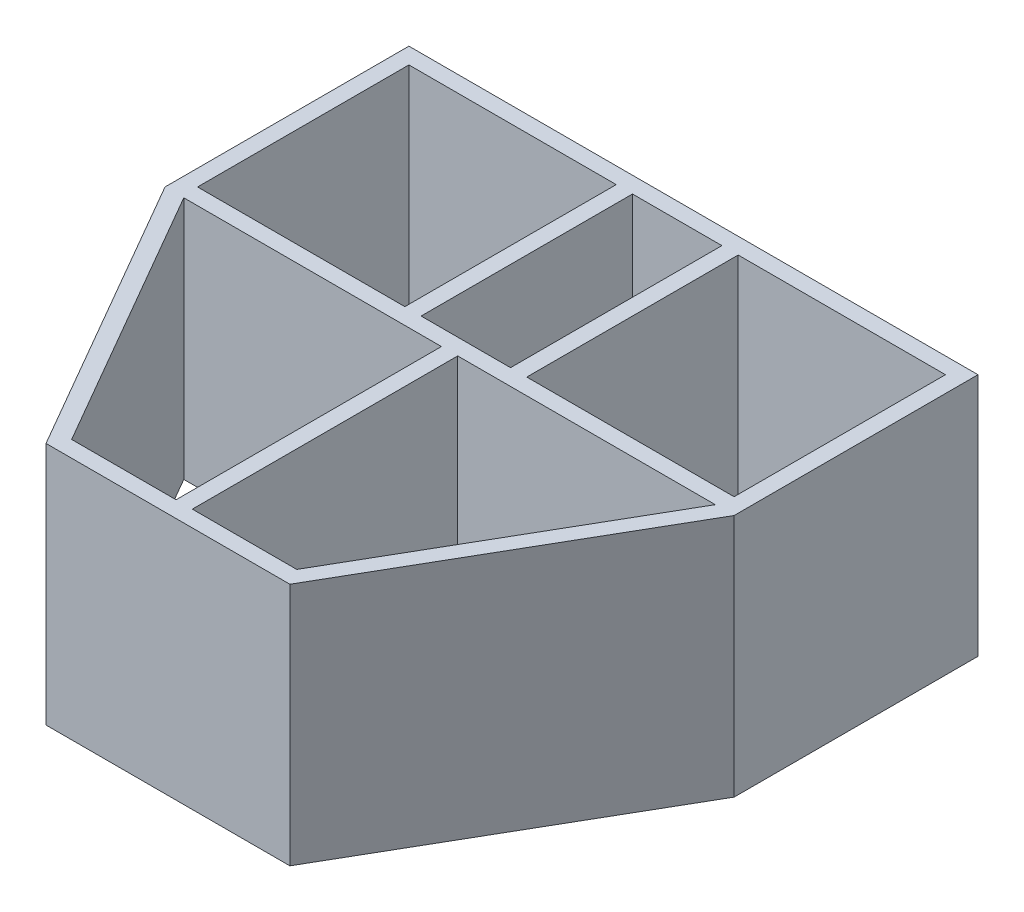
ISO-10303-21;
HEADER;
FILE_DESCRIPTION(('STEP AP214'),'2;1');
FILE_NAME('part.step','',(''),(''),'','','');
FILE_SCHEMA(('AUTOMOTIVE_DESIGN { 1 0 10303 214 1 1 1 1 }'));
ENDSEC;
DATA;
#1=APPLICATION_CONTEXT('core data for automotive mechanical design processes');
#2=APPLICATION_PROTOCOL_DEFINITION('international standard','automotive_design',2000,#1);
#3=PRODUCT_CONTEXT('',#1,'mechanical');
#4=PRODUCT('Part','Part','',(#3));
#5=PRODUCT_RELATED_PRODUCT_CATEGORY('part','',(#4));
#6=PRODUCT_DEFINITION_FORMATION('','',#4);
#7=PRODUCT_DEFINITION_CONTEXT('part definition',#1,'design');
#8=PRODUCT_DEFINITION('design','',#6,#7);
#9=PRODUCT_DEFINITION_SHAPE('','',#8);
#10=(LENGTH_UNIT() NAMED_UNIT(*) SI_UNIT(.MILLI.,.METRE.));
#11=(NAMED_UNIT(*) PLANE_ANGLE_UNIT() SI_UNIT($,.RADIAN.));
#12=(NAMED_UNIT(*) SI_UNIT($,.STERADIAN.) SOLID_ANGLE_UNIT());
#13=UNCERTAINTY_MEASURE_WITH_UNIT(LENGTH_MEASURE(1.E-05),#10,'distance_accuracy_value','');
#14=(GEOMETRIC_REPRESENTATION_CONTEXT(3) GLOBAL_UNCERTAINTY_ASSIGNED_CONTEXT((#13)) GLOBAL_UNIT_ASSIGNED_CONTEXT((#10,
#11,#12)) REPRESENTATION_CONTEXT('',''));
#15=CARTESIAN_POINT('',(0.,0.,0.));
#16=DIRECTION('',(0.,0.,1.));
#17=DIRECTION('',(1.,0.,0.));
#18=AXIS2_PLACEMENT_3D('',#15,#16,#17);
#19=CARTESIAN_POINT('',(0.,15.,0.));
#20=DIRECTION('',(0.,-1.,0.));
#21=DIRECTION('',(0.,0.,-1.));
#22=AXIS2_PLACEMENT_3D('',#19,#20,#21);
#23=PLANE('',#22);
#24=DIRECTION('',(-1.,0.,0.));
#25=VECTOR('',#24,1.);
#26=CARTESIAN_POINT('',(16.3452994616207,15.,0.));
#27=LINE('',#26,#25);
#28=CARTESIAN_POINT('',(16.3452994616207,15.,0.));
#29=VERTEX_POINT('',#28);
#30=CARTESIAN_POINT('',(0.500000000000004,15.,0.));
#31=VERTEX_POINT('',#30);
#32=EDGE_CURVE('E243',#29,#31,#27,.T.);
#33=ORIENTED_EDGE('',*,*,#32,.F.);
#34=DIRECTION('',(0.499999999999998,0.,-0.86602540378444));
#35=VECTOR('',#34,1.);
#36=CARTESIAN_POINT('',(6.92264973081037,15.,16.3205080756889));
#37=LINE('',#36,#35);
#38=CARTESIAN_POINT('',(6.92264973081037,15.,16.3205080756889));
#39=VERTEX_POINT('',#38);
#40=EDGE_CURVE('E251',#39,#29,#37,.T.);
#41=ORIENTED_EDGE('',*,*,#40,.F.);
#42=DIRECTION('',(1.,0.,0.));
#43=VECTOR('',#42,1.);
#44=CARTESIAN_POINT('',(0.500000000000006,15.,16.3205080756889));
#45=LINE('',#44,#43);
#46=CARTESIAN_POINT('',(0.500000000000006,15.,16.3205080756889));
#47=VERTEX_POINT('',#46);
#48=EDGE_CURVE('E248',#47,#39,#45,.T.);
#49=ORIENTED_EDGE('',*,*,#48,.F.);
#50=DIRECTION('',(0.,0.,1.));
#51=VECTOR('',#50,1.);
#52=CARTESIAN_POINT('',(0.500000000000004,15.,0.));
#53=LINE('',#52,#51);
#54=EDGE_CURVE('E245',#31,#47,#53,.T.);
#55=ORIENTED_EDGE('',*,*,#54,.F.);
#56=EDGE_LOOP('',(#33,#41,#49,#55));
#57=FACE_BOUND('',#56,.T.);
#58=DIRECTION('',(1.,0.,0.));
#59=VECTOR('',#58,1.);
#60=CARTESIAN_POINT('',(3.75,15.,-0.999999999999992));
#61=LINE('',#60,#59);
#62=CARTESIAN_POINT('',(3.75,15.,-0.999999999999992));
#63=VERTEX_POINT('',#62);
#64=CARTESIAN_POINT('',(16.5,15.,-0.999999999999992));
#65=VERTEX_POINT('',#64);
#66=EDGE_CURVE('E305',#63,#65,#61,.T.);
#67=ORIENTED_EDGE('',*,*,#66,.F.);
#68=DIRECTION('',(0.,0.,1.));
#69=VECTOR('',#68,1.);
#70=CARTESIAN_POINT('',(3.75,15.,-14.));
#71=LINE('',#70,#69);
#72=CARTESIAN_POINT('',(3.75,15.,-14.));
#73=VERTEX_POINT('',#72);
#74=EDGE_CURVE('E313',#73,#63,#71,.T.);
#75=ORIENTED_EDGE('',*,*,#74,.F.);
#76=DIRECTION('',(-1.,0.,0.));
#77=VECTOR('',#76,1.);
#78=CARTESIAN_POINT('',(3.75,15.,-14.));
#79=LINE('',#78,#77);
#80=CARTESIAN_POINT('',(16.5,15.,-14.));
#81=VERTEX_POINT('',#80);
#82=EDGE_CURVE('E310',#81,#73,#79,.T.);
#83=ORIENTED_EDGE('',*,*,#82,.F.);
#84=DIRECTION('',(0.,0.,-1.));
#85=VECTOR('',#84,1.);
#86=CARTESIAN_POINT('',(16.5,15.,-14.));
#87=LINE('',#86,#85);
#88=EDGE_CURVE('E307',#65,#81,#87,.T.);
#89=ORIENTED_EDGE('',*,*,#88,.F.);
#90=EDGE_LOOP('',(#67,#75,#83,#89));
#91=FACE_BOUND('',#90,.T.);
#92=DIRECTION('',(0.,0.,1.));
#93=VECTOR('',#92,1.);
#94=CARTESIAN_POINT('',(-17.5,15.,0.));
#95=LINE('',#94,#93);
#96=CARTESIAN_POINT('',(-17.5,15.,-15.));
#97=VERTEX_POINT('',#96);
#98=CARTESIAN_POINT('',(-17.5,15.,0.));
#99=VERTEX_POINT('',#98);
#100=EDGE_CURVE('E367',#97,#99,#95,.T.);
#101=ORIENTED_EDGE('',*,*,#100,.T.);
#102=DIRECTION('',(0.499999999999998,0.,0.86602540378444));
#103=VECTOR('',#102,1.);
#104=CARTESIAN_POINT('',(-7.49999999999999,15.,17.3205080756889));
#105=LINE('',#104,#103);
#106=CARTESIAN_POINT('',(-7.49999999999999,15.,17.3205080756889));
#107=VERTEX_POINT('',#106);
#108=EDGE_CURVE('E370',#99,#107,#105,.T.);
#109=ORIENTED_EDGE('',*,*,#108,.T.);
#110=DIRECTION('',(1.,0.,0.));
#111=VECTOR('',#110,1.);
#112=CARTESIAN_POINT('',(7.50000000000001,15.,17.3205080756889));
#113=LINE('',#112,#111);
#114=CARTESIAN_POINT('',(7.50000000000001,15.,17.3205080756889));
#115=VERTEX_POINT('',#114);
#116=EDGE_CURVE('E373',#107,#115,#113,.T.);
#117=ORIENTED_EDGE('',*,*,#116,.T.);
#118=DIRECTION('',(0.499999999999998,0.,-0.86602540378444));
#119=VECTOR('',#118,1.);
#120=CARTESIAN_POINT('',(17.5,15.,0.));
#121=LINE('',#120,#119);
#122=CARTESIAN_POINT('',(17.5,15.,0.));
#123=VERTEX_POINT('',#122);
#124=EDGE_CURVE('E375',#115,#123,#121,.T.);
#125=ORIENTED_EDGE('',*,*,#124,.T.);
#126=DIRECTION('',(0.,0.,-1.));
#127=VECTOR('',#126,1.);
#128=CARTESIAN_POINT('',(17.5,15.,-15.));
#129=LINE('',#128,#127);
#130=CARTESIAN_POINT('',(17.5,15.,-15.));
#131=VERTEX_POINT('',#130);
#132=EDGE_CURVE('E377',#123,#131,#129,.T.);
#133=ORIENTED_EDGE('',*,*,#132,.T.);
#134=DIRECTION('',(-1.,0.,0.));
#135=VECTOR('',#134,1.);
#136=CARTESIAN_POINT('',(-17.5,15.,-15.));
#137=LINE('',#136,#135);
#138=EDGE_CURVE('E379',#131,#97,#137,.T.);
#139=ORIENTED_EDGE('',*,*,#138,.T.);
#140=EDGE_LOOP('',(#101,#109,#117,#125,#133,#139));
#141=FACE_BOUND('',#140,.T.);
#142=DIRECTION('',(0.,0.,1.));
#143=VECTOR('',#142,1.);
#144=CARTESIAN_POINT('',(-16.5,15.,-14.));
#145=LINE('',#144,#143);
#146=CARTESIAN_POINT('',(-16.5,15.,-14.));
#147=VERTEX_POINT('',#146);
#148=CARTESIAN_POINT('',(-16.5,15.,-0.999999999999992));
#149=VERTEX_POINT('',#148);
#150=EDGE_CURVE('E336',#147,#149,#145,.T.);
#151=ORIENTED_EDGE('',*,*,#150,.F.);
#152=DIRECTION('',(-1.,0.,0.));
#153=VECTOR('',#152,1.);
#154=CARTESIAN_POINT('',(-16.5,15.,-14.));
#155=LINE('',#154,#153);
#156=CARTESIAN_POINT('',(-3.75,15.,-14.));
#157=VERTEX_POINT('',#156);
#158=EDGE_CURVE('E344',#157,#147,#155,.T.);
#159=ORIENTED_EDGE('',*,*,#158,.F.);
#160=DIRECTION('',(0.,0.,-1.));
#161=VECTOR('',#160,1.);
#162=CARTESIAN_POINT('',(-3.75,15.,-14.));
#163=LINE('',#162,#161);
#164=CARTESIAN_POINT('',(-3.75,15.,-0.999999999999992));
#165=VERTEX_POINT('',#164);
#166=EDGE_CURVE('E341',#165,#157,#163,.T.);
#167=ORIENTED_EDGE('',*,*,#166,.F.);
#168=DIRECTION('',(1.,0.,0.));
#169=VECTOR('',#168,1.);
#170=CARTESIAN_POINT('',(-16.5,15.,-0.999999999999992));
#171=LINE('',#170,#169);
#172=EDGE_CURVE('E338',#149,#165,#171,.T.);
#173=ORIENTED_EDGE('',*,*,#172,.F.);
#174=EDGE_LOOP('',(#151,#159,#167,#173));
#175=FACE_BOUND('',#174,.T.);
#176=DIRECTION('',(-1.,0.,0.));
#177=VECTOR('',#176,1.);
#178=CARTESIAN_POINT('',(-0.499999999999997,15.,0.));
#179=LINE('',#178,#177);
#180=CARTESIAN_POINT('',(-0.499999999999997,15.,0.));
#181=VERTEX_POINT('',#180);
#182=CARTESIAN_POINT('',(-16.3452994616207,15.,0.));
#183=VERTEX_POINT('',#182);
#184=EDGE_CURVE('E274',#181,#183,#179,.T.);
#185=ORIENTED_EDGE('',*,*,#184,.F.);
#186=DIRECTION('',(0.,0.,-1.));
#187=VECTOR('',#186,1.);
#188=CARTESIAN_POINT('',(-0.499999999999994,15.,16.3205080756889));
#189=LINE('',#188,#187);
#190=CARTESIAN_POINT('',(-0.499999999999994,15.,16.3205080756889));
#191=VERTEX_POINT('',#190);
#192=EDGE_CURVE('E282',#191,#181,#189,.T.);
#193=ORIENTED_EDGE('',*,*,#192,.F.);
#194=DIRECTION('',(1.,0.,0.));
#195=VECTOR('',#194,1.);
#196=CARTESIAN_POINT('',(-6.92264973081036,15.,16.3205080756889));
#197=LINE('',#196,#195);
#198=CARTESIAN_POINT('',(-6.92264973081036,15.,16.3205080756889));
#199=VERTEX_POINT('',#198);
#200=EDGE_CURVE('E279',#199,#191,#197,.T.);
#201=ORIENTED_EDGE('',*,*,#200,.F.);
#202=DIRECTION('',(0.499999999999998,0.,0.86602540378444));
#203=VECTOR('',#202,1.);
#204=CARTESIAN_POINT('',(-16.3452994616207,15.,0.));
#205=LINE('',#204,#203);
#206=EDGE_CURVE('E276',#183,#199,#205,.T.);
#207=ORIENTED_EDGE('',*,*,#206,.F.);
#208=EDGE_LOOP('',(#185,#193,#201,#207));
#209=FACE_BOUND('',#208,.T.);
#210=DIRECTION('',(-1.,0.,0.));
#211=VECTOR('',#210,1.);
#212=CARTESIAN_POINT('',(-2.75,15.,-14.));
#213=LINE('',#212,#211);
#214=CARTESIAN_POINT('',(2.75,15.,-14.));
#215=VERTEX_POINT('',#214);
#216=CARTESIAN_POINT('',(-2.75,15.,-14.));
#217=VERTEX_POINT('',#216);
#218=EDGE_CURVE('E207',#215,#217,#213,.T.);
#219=ORIENTED_EDGE('',*,*,#218,.F.);
#220=DIRECTION('',(0.,0.,-1.));
#221=VECTOR('',#220,1.);
#222=CARTESIAN_POINT('',(2.75,15.,-14.));
#223=LINE('',#222,#221);
#224=CARTESIAN_POINT('',(2.75,15.,-0.999999999999993));
#225=VERTEX_POINT('',#224);
#226=EDGE_CURVE('E229',#225,#215,#223,.T.);
#227=ORIENTED_EDGE('',*,*,#226,.F.);
#228=DIRECTION('',(1.,0.,0.));
#229=VECTOR('',#228,1.);
#230=CARTESIAN_POINT('',(-2.75,15.,-0.999999999999992));
#231=LINE('',#230,#229);
#232=CARTESIAN_POINT('',(-2.75,15.,-0.999999999999992));
#233=VERTEX_POINT('',#232);
#234=EDGE_CURVE('E227',#233,#225,#231,.T.);
#235=ORIENTED_EDGE('',*,*,#234,.F.);
#236=DIRECTION('',(0.,0.,1.));
#237=VECTOR('',#236,1.);
#238=CARTESIAN_POINT('',(-2.75,15.,-14.));
#239=LINE('',#238,#237);
#240=EDGE_CURVE('E215',#217,#233,#239,.T.);
#241=ORIENTED_EDGE('',*,*,#240,.F.);
#242=EDGE_LOOP('',(#219,#227,#235,#241));
#243=FACE_BOUND('',#242,.T.);
#244=ADVANCED_FACE('F34',(#57,#91,#141,#175,#209,#243),#23,.F.);
#245=CARTESIAN_POINT('',(0.,0.,0.));
#246=DIRECTION('',(0.,-1.,0.));
#247=DIRECTION('',(0.,0.,-1.));
#248=AXIS2_PLACEMENT_3D('',#245,#246,#247);
#249=PLANE('',#248);
#250=DIRECTION('',(0.499999999999998,0.,-0.86602540378444));
#251=VECTOR('',#250,1.);
#252=CARTESIAN_POINT('',(6.92264973081037,0.,16.3205080756889));
#253=LINE('',#252,#251);
#254=CARTESIAN_POINT('',(6.92264973081037,0.,16.3205080756889));
#255=VERTEX_POINT('',#254);
#256=CARTESIAN_POINT('',(16.3452994616207,0.,0.));
#257=VERTEX_POINT('',#256);
#258=EDGE_CURVE('E246',#255,#257,#253,.T.);
#259=ORIENTED_EDGE('',*,*,#258,.T.);
#260=DIRECTION('',(-1.,0.,0.));
#261=VECTOR('',#260,1.);
#262=CARTESIAN_POINT('',(16.3452994616207,0.,0.));
#263=LINE('',#262,#261);
#264=CARTESIAN_POINT('',(0.500000000000004,0.,0.));
#265=VERTEX_POINT('',#264);
#266=EDGE_CURVE('E223',#257,#265,#263,.T.);
#267=ORIENTED_EDGE('',*,*,#266,.T.);
#268=DIRECTION('',(0.,0.,1.));
#269=VECTOR('',#268,1.);
#270=CARTESIAN_POINT('',(0.500000000000004,0.,0.));
#271=LINE('',#270,#269);
#272=CARTESIAN_POINT('',(0.500000000000006,0.,16.3205080756889));
#273=VERTEX_POINT('',#272);
#274=EDGE_CURVE('E256',#265,#273,#271,.T.);
#275=ORIENTED_EDGE('',*,*,#274,.T.);
#276=DIRECTION('',(1.,0.,0.));
#277=VECTOR('',#276,1.);
#278=CARTESIAN_POINT('',(0.500000000000006,0.,16.3205080756889));
#279=LINE('',#278,#277);
#280=EDGE_CURVE('E259',#273,#255,#279,.T.);
#281=ORIENTED_EDGE('',*,*,#280,.T.);
#282=EDGE_LOOP('',(#259,#267,#275,#281));
#283=FACE_BOUND('',#282,.T.);
#284=DIRECTION('',(0.,0.,1.));
#285=VECTOR('',#284,1.);
#286=CARTESIAN_POINT('',(3.75,0.,-14.));
#287=LINE('',#286,#285);
#288=CARTESIAN_POINT('',(3.75,0.,-14.));
#289=VERTEX_POINT('',#288);
#290=CARTESIAN_POINT('',(3.75,0.,-0.999999999999992));
#291=VERTEX_POINT('',#290);
#292=EDGE_CURVE('E308',#289,#291,#287,.T.);
#293=ORIENTED_EDGE('',*,*,#292,.T.);
#294=DIRECTION('',(1.,0.,0.));
#295=VECTOR('',#294,1.);
#296=CARTESIAN_POINT('',(3.75,0.,-0.999999999999992));
#297=LINE('',#296,#295);
#298=CARTESIAN_POINT('',(16.5,0.,-0.999999999999992));
#299=VERTEX_POINT('',#298);
#300=EDGE_CURVE('E304',#291,#299,#297,.T.);
#301=ORIENTED_EDGE('',*,*,#300,.T.);
#302=DIRECTION('',(0.,0.,-1.));
#303=VECTOR('',#302,1.);
#304=CARTESIAN_POINT('',(16.5,0.,-14.));
#305=LINE('',#304,#303);
#306=CARTESIAN_POINT('',(16.5,0.,-14.));
#307=VERTEX_POINT('',#306);
#308=EDGE_CURVE('E318',#299,#307,#305,.T.);
#309=ORIENTED_EDGE('',*,*,#308,.T.);
#310=DIRECTION('',(-1.,0.,0.));
#311=VECTOR('',#310,1.);
#312=CARTESIAN_POINT('',(3.75,0.,-14.));
#313=LINE('',#312,#311);
#314=EDGE_CURVE('E321',#307,#289,#313,.T.);
#315=ORIENTED_EDGE('',*,*,#314,.T.);
#316=EDGE_LOOP('',(#293,#301,#309,#315));
#317=FACE_BOUND('',#316,.T.);
#318=DIRECTION('',(0.,0.,1.));
#319=VECTOR('',#318,1.);
#320=CARTESIAN_POINT('',(-17.5,0.,0.));
#321=LINE('',#320,#319);
#322=CARTESIAN_POINT('',(-17.5,0.,-15.));
#323=VERTEX_POINT('',#322);
#324=CARTESIAN_POINT('',(-17.5,0.,0.));
#325=VERTEX_POINT('',#324);
#326=EDGE_CURVE('E366',#323,#325,#321,.T.);
#327=ORIENTED_EDGE('',*,*,#326,.F.);
#328=DIRECTION('',(-1.,0.,0.));
#329=VECTOR('',#328,1.);
#330=CARTESIAN_POINT('',(-17.5,0.,-15.));
#331=LINE('',#330,#329);
#332=CARTESIAN_POINT('',(17.5,0.,-15.));
#333=VERTEX_POINT('',#332);
#334=EDGE_CURVE('E371',#333,#323,#331,.T.);
#335=ORIENTED_EDGE('',*,*,#334,.F.);
#336=DIRECTION('',(0.,0.,-1.));
#337=VECTOR('',#336,1.);
#338=CARTESIAN_POINT('',(17.5,0.,-15.));
#339=LINE('',#338,#337);
#340=CARTESIAN_POINT('',(17.5,0.,0.));
#341=VERTEX_POINT('',#340);
#342=EDGE_CURVE('E390',#341,#333,#339,.T.);
#343=ORIENTED_EDGE('',*,*,#342,.F.);
#344=DIRECTION('',(0.499999999999998,0.,-0.86602540378444));
#345=VECTOR('',#344,1.);
#346=CARTESIAN_POINT('',(17.5,0.,0.));
#347=LINE('',#346,#345);
#348=CARTESIAN_POINT('',(7.50000000000001,0.,17.3205080756889));
#349=VERTEX_POINT('',#348);
#350=EDGE_CURVE('E388',#349,#341,#347,.T.);
#351=ORIENTED_EDGE('',*,*,#350,.F.);
#352=DIRECTION('',(1.,0.,0.));
#353=VECTOR('',#352,1.);
#354=CARTESIAN_POINT('',(7.50000000000001,0.,17.3205080756889));
#355=LINE('',#354,#353);
#356=CARTESIAN_POINT('',(-7.49999999999999,0.,17.3205080756889));
#357=VERTEX_POINT('',#356);
#358=EDGE_CURVE('E386',#357,#349,#355,.T.);
#359=ORIENTED_EDGE('',*,*,#358,.F.);
#360=DIRECTION('',(0.499999999999998,0.,0.86602540378444));
#361=VECTOR('',#360,1.);
#362=CARTESIAN_POINT('',(-7.49999999999999,0.,17.3205080756889));
#363=LINE('',#362,#361);
#364=EDGE_CURVE('E384',#325,#357,#363,.T.);
#365=ORIENTED_EDGE('',*,*,#364,.F.);
#366=EDGE_LOOP('',(#327,#335,#343,#351,#359,#365));
#367=FACE_BOUND('',#366,.T.);
#368=DIRECTION('',(-1.,0.,0.));
#369=VECTOR('',#368,1.);
#370=CARTESIAN_POINT('',(-16.5,0.,-14.));
#371=LINE('',#370,#369);
#372=CARTESIAN_POINT('',(-3.75,0.,-14.));
#373=VERTEX_POINT('',#372);
#374=CARTESIAN_POINT('',(-16.5,0.,-14.));
#375=VERTEX_POINT('',#374);
#376=EDGE_CURVE('E339',#373,#375,#371,.T.);
#377=ORIENTED_EDGE('',*,*,#376,.T.);
#378=DIRECTION('',(0.,0.,1.));
#379=VECTOR('',#378,1.);
#380=CARTESIAN_POINT('',(-16.5,0.,-14.));
#381=LINE('',#380,#379);
#382=CARTESIAN_POINT('',(-16.5,0.,-0.999999999999992));
#383=VERTEX_POINT('',#382);
#384=EDGE_CURVE('E335',#375,#383,#381,.T.);
#385=ORIENTED_EDGE('',*,*,#384,.T.);
#386=DIRECTION('',(1.,0.,0.));
#387=VECTOR('',#386,1.);
#388=CARTESIAN_POINT('',(-16.5,0.,-0.999999999999992));
#389=LINE('',#388,#387);
#390=CARTESIAN_POINT('',(-3.75,0.,-0.999999999999992));
#391=VERTEX_POINT('',#390);
#392=EDGE_CURVE('E349',#383,#391,#389,.T.);
#393=ORIENTED_EDGE('',*,*,#392,.T.);
#394=DIRECTION('',(0.,0.,-1.));
#395=VECTOR('',#394,1.);
#396=CARTESIAN_POINT('',(-3.75,0.,-14.));
#397=LINE('',#396,#395);
#398=EDGE_CURVE('E352',#391,#373,#397,.T.);
#399=ORIENTED_EDGE('',*,*,#398,.T.);
#400=EDGE_LOOP('',(#377,#385,#393,#399));
#401=FACE_BOUND('',#400,.T.);
#402=DIRECTION('',(0.,0.,-1.));
#403=VECTOR('',#402,1.);
#404=CARTESIAN_POINT('',(-0.499999999999994,0.,16.3205080756889));
#405=LINE('',#404,#403);
#406=CARTESIAN_POINT('',(-0.499999999999994,0.,16.3205080756889));
#407=VERTEX_POINT('',#406);
#408=CARTESIAN_POINT('',(-0.499999999999997,0.,0.));
#409=VERTEX_POINT('',#408);
#410=EDGE_CURVE('E277',#407,#409,#405,.T.);
#411=ORIENTED_EDGE('',*,*,#410,.T.);
#412=DIRECTION('',(-1.,0.,0.));
#413=VECTOR('',#412,1.);
#414=CARTESIAN_POINT('',(-0.499999999999997,0.,0.));
#415=LINE('',#414,#413);
#416=CARTESIAN_POINT('',(-16.3452994616207,0.,0.));
#417=VERTEX_POINT('',#416);
#418=EDGE_CURVE('E273',#409,#417,#415,.T.);
#419=ORIENTED_EDGE('',*,*,#418,.T.);
#420=DIRECTION('',(0.499999999999998,0.,0.86602540378444));
#421=VECTOR('',#420,1.);
#422=CARTESIAN_POINT('',(-16.3452994616207,0.,0.));
#423=LINE('',#422,#421);
#424=CARTESIAN_POINT('',(-6.92264973081036,0.,16.3205080756889));
#425=VERTEX_POINT('',#424);
#426=EDGE_CURVE('E287',#417,#425,#423,.T.);
#427=ORIENTED_EDGE('',*,*,#426,.T.);
#428=DIRECTION('',(1.,0.,0.));
#429=VECTOR('',#428,1.);
#430=CARTESIAN_POINT('',(-6.92264973081036,0.,16.3205080756889));
#431=LINE('',#430,#429);
#432=EDGE_CURVE('E290',#425,#407,#431,.T.);
#433=ORIENTED_EDGE('',*,*,#432,.T.);
#434=EDGE_LOOP('',(#411,#419,#427,#433));
#435=FACE_BOUND('',#434,.T.);
#436=DIRECTION('',(0.,0.,-1.));
#437=VECTOR('',#436,1.);
#438=CARTESIAN_POINT('',(2.75,0.,-14.));
#439=LINE('',#438,#437);
#440=CARTESIAN_POINT('',(2.75,0.,-0.999999999999993));
#441=VERTEX_POINT('',#440);
#442=CARTESIAN_POINT('',(2.75,0.,-14.));
#443=VERTEX_POINT('',#442);
#444=EDGE_CURVE('E216',#441,#443,#439,.T.);
#445=ORIENTED_EDGE('',*,*,#444,.T.);
#446=DIRECTION('',(-1.,0.,0.));
#447=VECTOR('',#446,1.);
#448=CARTESIAN_POINT('',(-2.75,0.,-14.));
#449=LINE('',#448,#447);
#450=CARTESIAN_POINT('',(-2.75,0.,-14.));
#451=VERTEX_POINT('',#450);
#452=EDGE_CURVE('E57',#443,#451,#449,.T.);
#453=ORIENTED_EDGE('',*,*,#452,.T.);
#454=DIRECTION('',(0.,0.,1.));
#455=VECTOR('',#454,1.);
#456=CARTESIAN_POINT('',(-2.75,0.,-14.));
#457=LINE('',#456,#455);
#458=CARTESIAN_POINT('',(-2.75,0.,-0.999999999999992));
#459=VERTEX_POINT('',#458);
#460=EDGE_CURVE('E222',#451,#459,#457,.T.);
#461=ORIENTED_EDGE('',*,*,#460,.T.);
#462=DIRECTION('',(1.,0.,0.));
#463=VECTOR('',#462,1.);
#464=CARTESIAN_POINT('',(-2.75,0.,-0.999999999999992));
#465=LINE('',#464,#463);
#466=EDGE_CURVE('E235',#459,#441,#465,.T.);
#467=ORIENTED_EDGE('',*,*,#466,.T.);
#468=EDGE_LOOP('',(#445,#453,#461,#467));
#469=FACE_BOUND('',#468,.T.);
#470=ADVANCED_FACE('F414',(#283,#317,#367,#401,#435,#469),#249,.T.);
#471=CARTESIAN_POINT('',(-17.5,15.,0.));
#472=DIRECTION('',(1.,0.,0.));
#473=DIRECTION('',(0.,0.,-1.));
#474=AXIS2_PLACEMENT_3D('',#471,#472,#473);
#475=PLANE('',#474);
#476=ORIENTED_EDGE('',*,*,#326,.T.);
#477=DIRECTION('',(0.,-1.,0.));
#478=VECTOR('',#477,1.);
#479=CARTESIAN_POINT('',(-17.5,15.,0.));
#480=LINE('',#479,#478);
#481=EDGE_CURVE('E11',#99,#325,#480,.T.);
#482=ORIENTED_EDGE('',*,*,#481,.F.);
#483=ORIENTED_EDGE('',*,*,#100,.F.);
#484=DIRECTION('',(0.,-1.,0.));
#485=VECTOR('',#484,1.);
#486=CARTESIAN_POINT('',(-17.5,15.,-15.));
#487=LINE('',#486,#485);
#488=EDGE_CURVE('E381',#97,#323,#487,.T.);
#489=ORIENTED_EDGE('',*,*,#488,.T.);
#490=EDGE_LOOP('',(#476,#482,#483,#489));
#491=FACE_BOUND('',#490,.T.);
#492=ADVANCED_FACE('F36',(#491),#475,.F.);
#493=CARTESIAN_POINT('',(-7.49999999999999,15.,17.3205080756889));
#494=DIRECTION('',(0.86602540378444,0.,-0.499999999999998));
#495=DIRECTION('',(-0.499999999999998,0.,-0.86602540378444));
#496=AXIS2_PLACEMENT_3D('',#493,#494,#495);
#497=PLANE('',#496);
#498=ORIENTED_EDGE('',*,*,#364,.T.);
#499=DIRECTION('',(0.,-1.,0.));
#500=VECTOR('',#499,1.);
#501=CARTESIAN_POINT('',(-7.49999999999999,15.,17.3205080756889));
#502=LINE('',#501,#500);
#503=EDGE_CURVE('E42',#107,#357,#502,.T.);
#504=ORIENTED_EDGE('',*,*,#503,.F.);
#505=ORIENTED_EDGE('',*,*,#108,.F.);
#506=ORIENTED_EDGE('',*,*,#481,.T.);
#507=EDGE_LOOP('',(#498,#504,#505,#506));
#508=FACE_BOUND('',#507,.T.);
#509=ADVANCED_FACE('F432',(#508),#497,.F.);
#510=CARTESIAN_POINT('',(7.50000000000001,15.,17.3205080756889));
#511=DIRECTION('',(0.,0.,-1.));
#512=DIRECTION('',(-1.,0.,0.));
#513=AXIS2_PLACEMENT_3D('',#510,#511,#512);
#514=PLANE('',#513);
#515=ORIENTED_EDGE('',*,*,#358,.T.);
#516=DIRECTION('',(0.,-1.,0.));
#517=VECTOR('',#516,1.);
#518=CARTESIAN_POINT('',(7.50000000000001,15.,17.3205080756889));
#519=LINE('',#518,#517);
#520=EDGE_CURVE('E401',#115,#349,#519,.T.);
#521=ORIENTED_EDGE('',*,*,#520,.F.);
#522=ORIENTED_EDGE('',*,*,#116,.F.);
#523=ORIENTED_EDGE('',*,*,#503,.T.);
#524=EDGE_LOOP('',(#515,#521,#522,#523));
#525=FACE_BOUND('',#524,.T.);
#526=ADVANCED_FACE('F408',(#525),#514,.F.);
#527=CARTESIAN_POINT('',(17.5,15.,0.));
#528=DIRECTION('',(-0.86602540378444,0.,-0.499999999999998));
#529=DIRECTION('',(-0.499999999999998,0.,0.86602540378444));
#530=AXIS2_PLACEMENT_3D('',#527,#528,#529);
#531=PLANE('',#530);
#532=ORIENTED_EDGE('',*,*,#350,.T.);
#533=DIRECTION('',(0.,-1.,0.));
#534=VECTOR('',#533,1.);
#535=CARTESIAN_POINT('',(17.5,15.,0.));
#536=LINE('',#535,#534);
#537=EDGE_CURVE('E398',#123,#341,#536,.T.);
#538=ORIENTED_EDGE('',*,*,#537,.F.);
#539=ORIENTED_EDGE('',*,*,#124,.F.);
#540=ORIENTED_EDGE('',*,*,#520,.T.);
#541=EDGE_LOOP('',(#532,#538,#539,#540));
#542=FACE_BOUND('',#541,.T.);
#543=ADVANCED_FACE('F420',(#542),#531,.F.);
#544=CARTESIAN_POINT('',(17.5,15.,-15.));
#545=DIRECTION('',(-1.,0.,0.));
#546=DIRECTION('',(0.,0.,1.));
#547=AXIS2_PLACEMENT_3D('',#544,#545,#546);
#548=PLANE('',#547);
#549=ORIENTED_EDGE('',*,*,#342,.T.);
#550=DIRECTION('',(0.,-1.,0.));
#551=VECTOR('',#550,1.);
#552=CARTESIAN_POINT('',(17.5,15.,-15.));
#553=LINE('',#552,#551);
#554=EDGE_CURVE('E395',#131,#333,#553,.T.);
#555=ORIENTED_EDGE('',*,*,#554,.F.);
#556=ORIENTED_EDGE('',*,*,#132,.F.);
#557=ORIENTED_EDGE('',*,*,#537,.T.);
#558=EDGE_LOOP('',(#549,#555,#556,#557));
#559=FACE_BOUND('',#558,.T.);
#560=ADVANCED_FACE('F424',(#559),#548,.F.);
#561=CARTESIAN_POINT('',(-17.5,15.,-15.));
#562=DIRECTION('',(0.,0.,1.));
#563=DIRECTION('',(1.,0.,0.));
#564=AXIS2_PLACEMENT_3D('',#561,#562,#563);
#565=PLANE('',#564);
#566=ORIENTED_EDGE('',*,*,#334,.T.);
#567=ORIENTED_EDGE('',*,*,#488,.F.);
#568=ORIENTED_EDGE('',*,*,#138,.F.);
#569=ORIENTED_EDGE('',*,*,#554,.T.);
#570=EDGE_LOOP('',(#566,#567,#568,#569));
#571=FACE_BOUND('',#570,.T.);
#572=ADVANCED_FACE('F435',(#571),#565,.F.);
#573=CARTESIAN_POINT('',(-16.5,15.,-14.));
#574=DIRECTION('',(1.,0.,0.));
#575=DIRECTION('',(0.,0.,-1.));
#576=AXIS2_PLACEMENT_3D('',#573,#574,#575);
#577=PLANE('',#576);
#578=ORIENTED_EDGE('',*,*,#384,.F.);
#579=DIRECTION('',(0.,-1.,0.));
#580=VECTOR('',#579,1.);
#581=CARTESIAN_POINT('',(-16.5,15.,-14.));
#582=LINE('',#581,#580);
#583=EDGE_CURVE('E346',#147,#375,#582,.T.);
#584=ORIENTED_EDGE('',*,*,#583,.F.);
#585=ORIENTED_EDGE('',*,*,#150,.T.);
#586=DIRECTION('',(0.,-1.,0.));
#587=VECTOR('',#586,1.);
#588=CARTESIAN_POINT('',(-16.5,15.,-0.999999999999992));
#589=LINE('',#588,#587);
#590=EDGE_CURVE('E363',#149,#383,#589,.T.);
#591=ORIENTED_EDGE('',*,*,#590,.T.);
#592=EDGE_LOOP('',(#578,#584,#585,#591));
#593=FACE_BOUND('',#592,.T.);
#594=ADVANCED_FACE('F437',(#593),#577,.T.);
#595=CARTESIAN_POINT('',(-16.5,15.,-0.999999999999992));
#596=DIRECTION('',(0.,0.,-1.));
#597=DIRECTION('',(-1.,0.,0.));
#598=AXIS2_PLACEMENT_3D('',#595,#596,#597);
#599=PLANE('',#598);
#600=ORIENTED_EDGE('',*,*,#392,.F.);
#601=ORIENTED_EDGE('',*,*,#590,.F.);
#602=ORIENTED_EDGE('',*,*,#172,.T.);
#603=DIRECTION('',(0.,-1.,0.));
#604=VECTOR('',#603,1.);
#605=CARTESIAN_POINT('',(-3.75,15.,-0.999999999999992));
#606=LINE('',#605,#604);
#607=EDGE_CURVE('E361',#165,#391,#606,.T.);
#608=ORIENTED_EDGE('',*,*,#607,.T.);
#609=EDGE_LOOP('',(#600,#601,#602,#608));
#610=FACE_BOUND('',#609,.T.);
#611=ADVANCED_FACE('F443',(#610),#599,.T.);
#612=CARTESIAN_POINT('',(-3.75,15.,-14.));
#613=DIRECTION('',(-1.,0.,0.));
#614=DIRECTION('',(0.,0.,1.));
#615=AXIS2_PLACEMENT_3D('',#612,#613,#614);
#616=PLANE('',#615);
#617=ORIENTED_EDGE('',*,*,#398,.F.);
#618=ORIENTED_EDGE('',*,*,#607,.F.);
#619=ORIENTED_EDGE('',*,*,#166,.T.);
#620=DIRECTION('',(0.,-1.,0.));
#621=VECTOR('',#620,1.);
#622=CARTESIAN_POINT('',(-3.75,15.,-14.));
#623=LINE('',#622,#621);
#624=EDGE_CURVE('E359',#157,#373,#623,.T.);
#625=ORIENTED_EDGE('',*,*,#624,.T.);
#626=EDGE_LOOP('',(#617,#618,#619,#625));
#627=FACE_BOUND('',#626,.T.);
#628=ADVANCED_FACE('F460',(#627),#616,.T.);
#629=CARTESIAN_POINT('',(-16.5,15.,-14.));
#630=DIRECTION('',(0.,0.,1.));
#631=DIRECTION('',(1.,0.,0.));
#632=AXIS2_PLACEMENT_3D('',#629,#630,#631);
#633=PLANE('',#632);
#634=ORIENTED_EDGE('',*,*,#376,.F.);
#635=ORIENTED_EDGE('',*,*,#624,.F.);
#636=ORIENTED_EDGE('',*,*,#158,.T.);
#637=ORIENTED_EDGE('',*,*,#583,.T.);
#638=EDGE_LOOP('',(#634,#635,#636,#637));
#639=FACE_BOUND('',#638,.T.);
#640=ADVANCED_FACE('F464',(#639),#633,.T.);
#641=CARTESIAN_POINT('',(3.75,15.,-0.999999999999992));
#642=DIRECTION('',(0.,0.,-1.));
#643=DIRECTION('',(-1.,0.,0.));
#644=AXIS2_PLACEMENT_3D('',#641,#642,#643);
#645=PLANE('',#644);
#646=ORIENTED_EDGE('',*,*,#300,.F.);
#647=DIRECTION('',(0.,-1.,0.));
#648=VECTOR('',#647,1.);
#649=CARTESIAN_POINT('',(3.75,15.,-0.999999999999992));
#650=LINE('',#649,#648);
#651=EDGE_CURVE('E315',#63,#291,#650,.T.);
#652=ORIENTED_EDGE('',*,*,#651,.F.);
#653=ORIENTED_EDGE('',*,*,#66,.T.);
#654=DIRECTION('',(0.,-1.,0.));
#655=VECTOR('',#654,1.);
#656=CARTESIAN_POINT('',(16.5,15.,-0.999999999999992));
#657=LINE('',#656,#655);
#658=EDGE_CURVE('E332',#65,#299,#657,.T.);
#659=ORIENTED_EDGE('',*,*,#658,.T.);
#660=EDGE_LOOP('',(#646,#652,#653,#659));
#661=FACE_BOUND('',#660,.T.);
#662=ADVANCED_FACE('F468',(#661),#645,.T.);
#663=CARTESIAN_POINT('',(16.5,15.,-14.));
#664=DIRECTION('',(-1.,0.,0.));
#665=DIRECTION('',(0.,0.,1.));
#666=AXIS2_PLACEMENT_3D('',#663,#664,#665);
#667=PLANE('',#666);
#668=ORIENTED_EDGE('',*,*,#308,.F.);
#669=ORIENTED_EDGE('',*,*,#658,.F.);
#670=ORIENTED_EDGE('',*,*,#88,.T.);
#671=DIRECTION('',(0.,-1.,0.));
#672=VECTOR('',#671,1.);
#673=CARTESIAN_POINT('',(16.5,15.,-14.));
#674=LINE('',#673,#672);
#675=EDGE_CURVE('E330',#81,#307,#674,.T.);
#676=ORIENTED_EDGE('',*,*,#675,.T.);
#677=EDGE_LOOP('',(#668,#669,#670,#676));
#678=FACE_BOUND('',#677,.T.);
#679=ADVANCED_FACE('F472',(#678),#667,.T.);
#680=CARTESIAN_POINT('',(3.75,15.,-14.));
#681=DIRECTION('',(0.,0.,1.));
#682=DIRECTION('',(1.,0.,0.));
#683=AXIS2_PLACEMENT_3D('',#680,#681,#682);
#684=PLANE('',#683);
#685=ORIENTED_EDGE('',*,*,#314,.F.);
#686=ORIENTED_EDGE('',*,*,#675,.F.);
#687=ORIENTED_EDGE('',*,*,#82,.T.);
#688=DIRECTION('',(0.,-1.,0.));
#689=VECTOR('',#688,1.);
#690=CARTESIAN_POINT('',(3.75,15.,-14.));
#691=LINE('',#690,#689);
#692=EDGE_CURVE('E328',#73,#289,#691,.T.);
#693=ORIENTED_EDGE('',*,*,#692,.T.);
#694=EDGE_LOOP('',(#685,#686,#687,#693));
#695=FACE_BOUND('',#694,.T.);
#696=ADVANCED_FACE('F476',(#695),#684,.T.);
#697=CARTESIAN_POINT('',(3.75,15.,-14.));
#698=DIRECTION('',(1.,0.,0.));
#699=DIRECTION('',(0.,0.,-1.));
#700=AXIS2_PLACEMENT_3D('',#697,#698,#699);
#701=PLANE('',#700);
#702=ORIENTED_EDGE('',*,*,#292,.F.);
#703=ORIENTED_EDGE('',*,*,#692,.F.);
#704=ORIENTED_EDGE('',*,*,#74,.T.);
#705=ORIENTED_EDGE('',*,*,#651,.T.);
#706=EDGE_LOOP('',(#702,#703,#704,#705));
#707=FACE_BOUND('',#706,.T.);
#708=ADVANCED_FACE('F480',(#707),#701,.T.);
#709=CARTESIAN_POINT('',(-0.499999999999997,15.,0.));
#710=DIRECTION('',(0.,0.,1.));
#711=DIRECTION('',(1.,0.,0.));
#712=AXIS2_PLACEMENT_3D('',#709,#710,#711);
#713=PLANE('',#712);
#714=ORIENTED_EDGE('',*,*,#418,.F.);
#715=DIRECTION('',(0.,-1.,0.));
#716=VECTOR('',#715,1.);
#717=CARTESIAN_POINT('',(-0.499999999999997,15.,0.));
#718=LINE('',#717,#716);
#719=EDGE_CURVE('E284',#181,#409,#718,.T.);
#720=ORIENTED_EDGE('',*,*,#719,.F.);
#721=ORIENTED_EDGE('',*,*,#184,.T.);
#722=DIRECTION('',(0.,-1.,0.));
#723=VECTOR('',#722,1.);
#724=CARTESIAN_POINT('',(-16.3452994616207,15.,0.));
#725=LINE('',#724,#723);
#726=EDGE_CURVE('E301',#183,#417,#725,.T.);
#727=ORIENTED_EDGE('',*,*,#726,.T.);
#728=EDGE_LOOP('',(#714,#720,#721,#727));
#729=FACE_BOUND('',#728,.T.);
#730=ADVANCED_FACE('F484',(#729),#713,.T.);
#731=CARTESIAN_POINT('',(-16.3452994616207,15.,0.));
#732=DIRECTION('',(0.86602540378444,0.,-0.499999999999998));
#733=DIRECTION('',(-0.499999999999998,0.,-0.86602540378444));
#734=AXIS2_PLACEMENT_3D('',#731,#732,#733);
#735=PLANE('',#734);
#736=ORIENTED_EDGE('',*,*,#426,.F.);
#737=ORIENTED_EDGE('',*,*,#726,.F.);
#738=ORIENTED_EDGE('',*,*,#206,.T.);
#739=DIRECTION('',(0.,-1.,0.));
#740=VECTOR('',#739,1.);
#741=CARTESIAN_POINT('',(-6.92264973081036,15.,16.3205080756889));
#742=LINE('',#741,#740);
#743=EDGE_CURVE('E299',#199,#425,#742,.T.);
#744=ORIENTED_EDGE('',*,*,#743,.T.);
#745=EDGE_LOOP('',(#736,#737,#738,#744));
#746=FACE_BOUND('',#745,.T.);
#747=ADVANCED_FACE('F488',(#746),#735,.T.);
#748=CARTESIAN_POINT('',(-6.92264973081036,15.,16.3205080756889));
#749=DIRECTION('',(0.,0.,-1.));
#750=DIRECTION('',(-1.,0.,0.));
#751=AXIS2_PLACEMENT_3D('',#748,#749,#750);
#752=PLANE('',#751);
#753=ORIENTED_EDGE('',*,*,#432,.F.);
#754=ORIENTED_EDGE('',*,*,#743,.F.);
#755=ORIENTED_EDGE('',*,*,#200,.T.);
#756=DIRECTION('',(0.,-1.,0.));
#757=VECTOR('',#756,1.);
#758=CARTESIAN_POINT('',(-0.499999999999994,15.,16.3205080756889));
#759=LINE('',#758,#757);
#760=EDGE_CURVE('E297',#191,#407,#759,.T.);
#761=ORIENTED_EDGE('',*,*,#760,.T.);
#762=EDGE_LOOP('',(#753,#754,#755,#761));
#763=FACE_BOUND('',#762,.T.);
#764=ADVANCED_FACE('F492',(#763),#752,.T.);
#765=CARTESIAN_POINT('',(-0.499999999999994,15.,16.3205080756889));
#766=DIRECTION('',(-1.,0.,0.));
#767=DIRECTION('',(0.,0.,1.));
#768=AXIS2_PLACEMENT_3D('',#765,#766,#767);
#769=PLANE('',#768);
#770=ORIENTED_EDGE('',*,*,#410,.F.);
#771=ORIENTED_EDGE('',*,*,#760,.F.);
#772=ORIENTED_EDGE('',*,*,#192,.T.);
#773=ORIENTED_EDGE('',*,*,#719,.T.);
#774=EDGE_LOOP('',(#770,#771,#772,#773));
#775=FACE_BOUND('',#774,.T.);
#776=ADVANCED_FACE('F496',(#775),#769,.T.);
#777=CARTESIAN_POINT('',(16.3452994616207,15.,0.));
#778=DIRECTION('',(0.,0.,1.));
#779=DIRECTION('',(1.,0.,0.));
#780=AXIS2_PLACEMENT_3D('',#777,#778,#779);
#781=PLANE('',#780);
#782=ORIENTED_EDGE('',*,*,#266,.F.);
#783=DIRECTION('',(0.,-1.,0.));
#784=VECTOR('',#783,1.);
#785=CARTESIAN_POINT('',(16.3452994616207,15.,0.));
#786=LINE('',#785,#784);
#787=EDGE_CURVE('E253',#29,#257,#786,.T.);
#788=ORIENTED_EDGE('',*,*,#787,.F.);
#789=ORIENTED_EDGE('',*,*,#32,.T.);
#790=DIRECTION('',(0.,-1.,0.));
#791=VECTOR('',#790,1.);
#792=CARTESIAN_POINT('',(0.500000000000004,15.,0.));
#793=LINE('',#792,#791);
#794=EDGE_CURVE('E270',#31,#265,#793,.T.);
#795=ORIENTED_EDGE('',*,*,#794,.T.);
#796=EDGE_LOOP('',(#782,#788,#789,#795));
#797=FACE_BOUND('',#796,.T.);
#798=ADVANCED_FACE('F500',(#797),#781,.T.);
#799=CARTESIAN_POINT('',(0.500000000000004,15.,0.));
#800=DIRECTION('',(1.,0.,0.));
#801=DIRECTION('',(0.,0.,-1.));
#802=AXIS2_PLACEMENT_3D('',#799,#800,#801);
#803=PLANE('',#802);
#804=ORIENTED_EDGE('',*,*,#274,.F.);
#805=ORIENTED_EDGE('',*,*,#794,.F.);
#806=ORIENTED_EDGE('',*,*,#54,.T.);
#807=DIRECTION('',(0.,-1.,0.));
#808=VECTOR('',#807,1.);
#809=CARTESIAN_POINT('',(0.500000000000006,15.,16.3205080756889));
#810=LINE('',#809,#808);
#811=EDGE_CURVE('E268',#47,#273,#810,.T.);
#812=ORIENTED_EDGE('',*,*,#811,.T.);
#813=EDGE_LOOP('',(#804,#805,#806,#812));
#814=FACE_BOUND('',#813,.T.);
#815=ADVANCED_FACE('F504',(#814),#803,.T.);
#816=CARTESIAN_POINT('',(0.500000000000006,15.,16.3205080756889));
#817=DIRECTION('',(0.,0.,-1.));
#818=DIRECTION('',(-1.,0.,0.));
#819=AXIS2_PLACEMENT_3D('',#816,#817,#818);
#820=PLANE('',#819);
#821=ORIENTED_EDGE('',*,*,#280,.F.);
#822=ORIENTED_EDGE('',*,*,#811,.F.);
#823=ORIENTED_EDGE('',*,*,#48,.T.);
#824=DIRECTION('',(0.,-1.,0.));
#825=VECTOR('',#824,1.);
#826=CARTESIAN_POINT('',(6.92264973081037,15.,16.3205080756889));
#827=LINE('',#826,#825);
#828=EDGE_CURVE('E266',#39,#255,#827,.T.);
#829=ORIENTED_EDGE('',*,*,#828,.T.);
#830=EDGE_LOOP('',(#821,#822,#823,#829));
#831=FACE_BOUND('',#830,.T.);
#832=ADVANCED_FACE('F508',(#831),#820,.T.);
#833=CARTESIAN_POINT('',(6.92264973081037,15.,16.3205080756889));
#834=DIRECTION('',(-0.86602540378444,0.,-0.499999999999998));
#835=DIRECTION('',(-0.499999999999998,0.,0.86602540378444));
#836=AXIS2_PLACEMENT_3D('',#833,#834,#835);
#837=PLANE('',#836);
#838=ORIENTED_EDGE('',*,*,#258,.F.);
#839=ORIENTED_EDGE('',*,*,#828,.F.);
#840=ORIENTED_EDGE('',*,*,#40,.T.);
#841=ORIENTED_EDGE('',*,*,#787,.T.);
#842=EDGE_LOOP('',(#838,#839,#840,#841));
#843=FACE_BOUND('',#842,.T.);
#844=ADVANCED_FACE('F512',(#843),#837,.T.);
#845=CARTESIAN_POINT('',(-2.75,15.,-14.));
#846=DIRECTION('',(0.,0.,1.));
#847=DIRECTION('',(1.,0.,0.));
#848=AXIS2_PLACEMENT_3D('',#845,#846,#847);
#849=PLANE('',#848);
#850=ORIENTED_EDGE('',*,*,#452,.F.);
#851=DIRECTION('',(0.,-1.,0.));
#852=VECTOR('',#851,1.);
#853=CARTESIAN_POINT('',(2.75,15.,-14.));
#854=LINE('',#853,#852);
#855=EDGE_CURVE('E211',#215,#443,#854,.T.);
#856=ORIENTED_EDGE('',*,*,#855,.F.);
#857=ORIENTED_EDGE('',*,*,#218,.T.);
#858=DIRECTION('',(0.,-1.,0.));
#859=VECTOR('',#858,1.);
#860=CARTESIAN_POINT('',(-2.75,15.,-14.));
#861=LINE('',#860,#859);
#862=EDGE_CURVE('E210',#217,#451,#861,.T.);
#863=ORIENTED_EDGE('',*,*,#862,.T.);
#864=EDGE_LOOP('',(#850,#856,#857,#863));
#865=FACE_BOUND('',#864,.T.);
#866=ADVANCED_FACE('F209',(#865),#849,.T.);
#867=CARTESIAN_POINT('',(-2.75,15.,-14.));
#868=DIRECTION('',(1.,0.,0.));
#869=DIRECTION('',(0.,0.,-1.));
#870=AXIS2_PLACEMENT_3D('',#867,#868,#869);
#871=PLANE('',#870);
#872=ORIENTED_EDGE('',*,*,#460,.F.);
#873=ORIENTED_EDGE('',*,*,#862,.F.);
#874=ORIENTED_EDGE('',*,*,#240,.T.);
#875=DIRECTION('',(0.,-1.,0.));
#876=VECTOR('',#875,1.);
#877=CARTESIAN_POINT('',(-2.75,15.,-0.999999999999992));
#878=LINE('',#877,#876);
#879=EDGE_CURVE('E224',#233,#459,#878,.T.);
#880=ORIENTED_EDGE('',*,*,#879,.T.);
#881=EDGE_LOOP('',(#872,#873,#874,#880));
#882=FACE_BOUND('',#881,.T.);
#883=ADVANCED_FACE('F219',(#882),#871,.T.);
#884=CARTESIAN_POINT('',(-2.75,15.,-0.999999999999992));
#885=DIRECTION('',(0.,0.,-1.));
#886=DIRECTION('',(-1.,0.,0.));
#887=AXIS2_PLACEMENT_3D('',#884,#885,#886);
#888=PLANE('',#887);
#889=ORIENTED_EDGE('',*,*,#466,.F.);
#890=ORIENTED_EDGE('',*,*,#879,.F.);
#891=ORIENTED_EDGE('',*,*,#234,.T.);
#892=DIRECTION('',(0.,-1.,0.));
#893=VECTOR('',#892,1.);
#894=CARTESIAN_POINT('',(2.75,15.,-0.999999999999993));
#895=LINE('',#894,#893);
#896=EDGE_CURVE('E49',#225,#441,#895,.T.);
#897=ORIENTED_EDGE('',*,*,#896,.T.);
#898=EDGE_LOOP('',(#889,#890,#891,#897));
#899=FACE_BOUND('',#898,.T.);
#900=ADVANCED_FACE('F521',(#899),#888,.T.);
#901=CARTESIAN_POINT('',(2.75,15.,-14.));
#902=DIRECTION('',(-1.,0.,0.));
#903=DIRECTION('',(0.,0.,1.));
#904=AXIS2_PLACEMENT_3D('',#901,#902,#903);
#905=PLANE('',#904);
#906=ORIENTED_EDGE('',*,*,#444,.F.);
#907=ORIENTED_EDGE('',*,*,#896,.F.);
#908=ORIENTED_EDGE('',*,*,#226,.T.);
#909=ORIENTED_EDGE('',*,*,#855,.T.);
#910=EDGE_LOOP('',(#906,#907,#908,#909));
#911=FACE_BOUND('',#910,.T.);
#912=ADVANCED_FACE('F524',(#911),#905,.T.);
#913=CLOSED_SHELL('',(#244,#470,#492,#509,#526,#543,#560,#572,#594,#611,#628,#640,#662,#679,
#696,#708,#730,#747,#764,#776,#798,#815,#832,#844,#866,#883,#900,#912));
#914=MANIFOLD_SOLID_BREP('B2',#913);
#915=ADVANCED_BREP_SHAPE_REPRESENTATION('',(#18,#914),#14);
#916=SHAPE_DEFINITION_REPRESENTATION(#9,#915);
ENDSEC;
END-ISO-10303-21;
